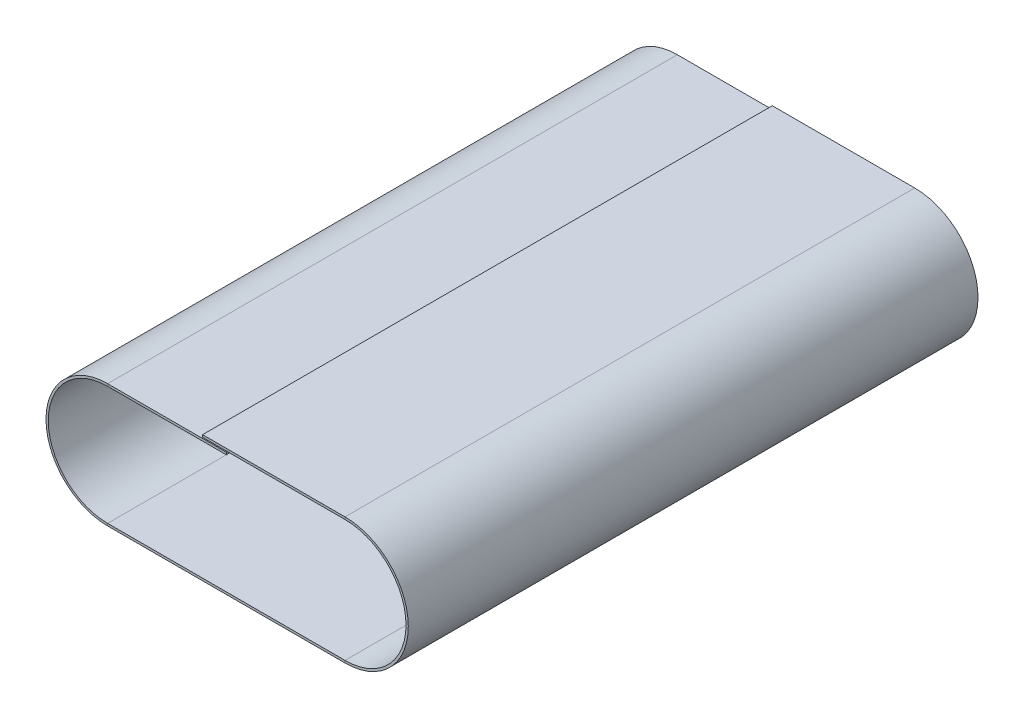
ISO-10303-21;
HEADER;
FILE_DESCRIPTION(('STEP AP214'),'2;1');
FILE_NAME('part.step','',(''),(''),'','','');
FILE_SCHEMA(('AUTOMOTIVE_DESIGN { 1 0 10303 214 1 1 1 1 }'));
ENDSEC;
DATA;
#1=APPLICATION_CONTEXT('core data for automotive mechanical design processes');
#2=APPLICATION_PROTOCOL_DEFINITION('international standard','automotive_design',2000,#1);
#3=PRODUCT_CONTEXT('',#1,'mechanical');
#4=PRODUCT('Part','Part','',(#3));
#5=PRODUCT_RELATED_PRODUCT_CATEGORY('part','',(#4));
#6=PRODUCT_DEFINITION_FORMATION('','',#4);
#7=PRODUCT_DEFINITION_CONTEXT('part definition',#1,'design');
#8=PRODUCT_DEFINITION('design','',#6,#7);
#9=PRODUCT_DEFINITION_SHAPE('','',#8);
#10=(LENGTH_UNIT() NAMED_UNIT(*) SI_UNIT(.MILLI.,.METRE.));
#11=(NAMED_UNIT(*) PLANE_ANGLE_UNIT() SI_UNIT($,.RADIAN.));
#12=(NAMED_UNIT(*) SI_UNIT($,.STERADIAN.) SOLID_ANGLE_UNIT());
#13=UNCERTAINTY_MEASURE_WITH_UNIT(LENGTH_MEASURE(1.E-05),#10,'distance_accuracy_value','');
#14=(GEOMETRIC_REPRESENTATION_CONTEXT(3) GLOBAL_UNCERTAINTY_ASSIGNED_CONTEXT((#13)) GLOBAL_UNIT_ASSIGNED_CONTEXT((#10,
#11,#12)) REPRESENTATION_CONTEXT('',''));
#15=CARTESIAN_POINT('',(0.,0.,0.));
#16=DIRECTION('',(0.,0.,1.));
#17=DIRECTION('',(1.,0.,0.));
#18=AXIS2_PLACEMENT_3D('',#15,#16,#17);
#19=CARTESIAN_POINT('',(0.,0.,304.8));
#20=DIRECTION('',(0.,0.,1.));
#21=DIRECTION('',(1.,0.,0.));
#22=AXIS2_PLACEMENT_3D('',#19,#20,#21);
#23=PLANE('',#22);
#24=DIRECTION('',(0.,-1.,0.));
#25=VECTOR('',#24,1.);
#26=CARTESIAN_POINT('',(0.,0.,304.8));
#27=LINE('',#26,#25);
#28=CARTESIAN_POINT('',(0.,0.,304.8));
#29=VERTEX_POINT('',#28);
#30=CARTESIAN_POINT('',(0.,-1.2192,304.8));
#31=VERTEX_POINT('',#30);
#32=EDGE_CURVE('E11',#29,#31,#27,.T.);
#33=ORIENTED_EDGE('',*,*,#32,.F.);
#34=CARTESIAN_POINT('',(0.,31.75,304.8));
#35=DIRECTION('',(0.,0.,1.));
#36=DIRECTION('',(-1.,0.,0.));
#37=AXIS2_PLACEMENT_3D('',#34,#35,#36);
#38=CIRCLE('',#37,31.75);
#39=CARTESIAN_POINT('',(0.,63.5,304.8));
#40=VERTEX_POINT('',#39);
#41=EDGE_CURVE('E247',#40,#29,#38,.T.);
#42=ORIENTED_EDGE('',*,*,#41,.F.);
#43=DIRECTION('',(0.,-1.,0.));
#44=VECTOR('',#43,1.);
#45=CARTESIAN_POINT('',(0.,64.7192,304.8));
#46=LINE('',#45,#44);
#47=CARTESIAN_POINT('',(0.,64.7192,304.8));
#48=VERTEX_POINT('',#47);
#49=EDGE_CURVE('E45',#48,#40,#46,.T.);
#50=ORIENTED_EDGE('',*,*,#49,.F.);
#51=CARTESIAN_POINT('',(0.,31.75,304.8));
#52=DIRECTION('',(0.,0.,1.));
#53=DIRECTION('',(1.,0.,0.));
#54=AXIS2_PLACEMENT_3D('',#51,#52,#53);
#55=CIRCLE('',#54,32.9692);
#56=EDGE_CURVE('E146',#48,#31,#55,.T.);
#57=ORIENTED_EDGE('',*,*,#56,.T.);
#58=EDGE_LOOP('',(#33,#42,#50,#57));
#59=FACE_BOUND('',#58,.T.);
#60=ADVANCED_FACE('F37',(#59),#23,.T.);
#61=CARTESIAN_POINT('',(0.,64.7192,304.8));
#62=DIRECTION('',(0.,0.,1.));
#63=DIRECTION('',(1.,0.,0.));
#64=AXIS2_PLACEMENT_3D('',#61,#62,#63);
#65=PLANE('',#64);
#66=DIRECTION('',(1.,0.,0.));
#67=VECTOR('',#66,1.);
#68=CARTESIAN_POINT('',(0.,0.,304.8));
#69=LINE('',#68,#67);
#70=CARTESIAN_POINT('',(127.,0.,304.8));
#71=VERTEX_POINT('',#70);
#72=EDGE_CURVE('E140',#29,#71,#69,.T.);
#73=ORIENTED_EDGE('',*,*,#72,.F.);
#74=ORIENTED_EDGE('',*,*,#32,.T.);
#75=DIRECTION('',(1.,0.,0.));
#76=VECTOR('',#75,1.);
#77=CARTESIAN_POINT('',(0.,-1.2192,304.8));
#78=LINE('',#77,#76);
#79=CARTESIAN_POINT('',(127.,-1.21919999999999,304.8));
#80=VERTEX_POINT('',#79);
#81=EDGE_CURVE('E137',#31,#80,#78,.T.);
#82=ORIENTED_EDGE('',*,*,#81,.T.);
#83=DIRECTION('',(0.,1.,0.));
#84=VECTOR('',#83,1.);
#85=CARTESIAN_POINT('',(127.,-1.21919999999999,304.8));
#86=LINE('',#85,#84);
#87=EDGE_CURVE('E228',#80,#71,#86,.T.);
#88=ORIENTED_EDGE('',*,*,#87,.T.);
#89=EDGE_LOOP('',(#73,#74,#82,#88));
#90=FACE_BOUND('',#89,.T.);
#91=ADVANCED_FACE('F135',(#90),#65,.T.);
#92=CARTESIAN_POINT('',(0.,63.5,0.));
#93=DIRECTION('',(0.,0.,-1.));
#94=DIRECTION('',(-1.,0.,0.));
#95=AXIS2_PLACEMENT_3D('',#92,#93,#94);
#96=PLANE('',#95);
#97=DIRECTION('',(0.,1.,0.));
#98=VECTOR('',#97,1.);
#99=CARTESIAN_POINT('',(0.,63.5,0.));
#100=LINE('',#99,#98);
#101=CARTESIAN_POINT('',(0.,63.5,0.));
#102=VERTEX_POINT('',#101);
#103=CARTESIAN_POINT('',(0.,64.7192,0.));
#104=VERTEX_POINT('',#103);
#105=EDGE_CURVE('E233',#102,#104,#100,.T.);
#106=ORIENTED_EDGE('',*,*,#105,.F.);
#107=CARTESIAN_POINT('',(0.,31.75,0.));
#108=DIRECTION('',(0.,0.,1.));
#109=DIRECTION('',(-1.,0.,0.));
#110=AXIS2_PLACEMENT_3D('',#107,#108,#109);
#111=CIRCLE('',#110,31.75);
#112=CARTESIAN_POINT('',(0.,0.,0.));
#113=VERTEX_POINT('',#112);
#114=EDGE_CURVE('E185',#102,#113,#111,.T.);
#115=ORIENTED_EDGE('',*,*,#114,.T.);
#116=DIRECTION('',(0.,1.,0.));
#117=VECTOR('',#116,1.);
#118=CARTESIAN_POINT('',(0.,-1.2192,0.));
#119=LINE('',#118,#117);
#120=CARTESIAN_POINT('',(0.,-1.2192,0.));
#121=VERTEX_POINT('',#120);
#122=EDGE_CURVE('E231',#121,#113,#119,.T.);
#123=ORIENTED_EDGE('',*,*,#122,.F.);
#124=CARTESIAN_POINT('',(0.,31.75,0.));
#125=DIRECTION('',(0.,0.,1.));
#126=DIRECTION('',(1.,0.,0.));
#127=AXIS2_PLACEMENT_3D('',#124,#125,#126);
#128=CIRCLE('',#127,32.9692);
#129=EDGE_CURVE('E158',#104,#121,#128,.T.);
#130=ORIENTED_EDGE('',*,*,#129,.F.);
#131=EDGE_LOOP('',(#106,#115,#123,#130));
#132=FACE_BOUND('',#131,.T.);
#133=ADVANCED_FACE('F285',(#132),#96,.T.);
#134=CARTESIAN_POINT('',(0.,-1.2192,0.));
#135=DIRECTION('',(0.,0.,-1.));
#136=DIRECTION('',(-1.,0.,0.));
#137=AXIS2_PLACEMENT_3D('',#134,#135,#136);
#138=PLANE('',#137);
#139=DIRECTION('',(-1.,0.,0.));
#140=VECTOR('',#139,1.);
#141=CARTESIAN_POINT('',(0.,63.5,0.));
#142=LINE('',#141,#140);
#143=CARTESIAN_POINT('',(63.5,63.5,0.));
#144=VERTEX_POINT('',#143);
#145=EDGE_CURVE('E188',#144,#102,#142,.T.);
#146=ORIENTED_EDGE('',*,*,#145,.T.);
#147=ORIENTED_EDGE('',*,*,#105,.T.);
#148=DIRECTION('',(1.,0.,0.));
#149=VECTOR('',#148,1.);
#150=CARTESIAN_POINT('',(0.,64.7192,0.));
#151=LINE('',#150,#149);
#152=CARTESIAN_POINT('',(63.5,64.7192,0.));
#153=VERTEX_POINT('',#152);
#154=EDGE_CURVE('E194',#153,#104,#151,.F.);
#155=ORIENTED_EDGE('',*,*,#154,.F.);
#156=DIRECTION('',(0.,-1.,0.));
#157=VECTOR('',#156,1.);
#158=CARTESIAN_POINT('',(63.5,64.7192,0.));
#159=LINE('',#158,#157);
#160=EDGE_CURVE('E191',#153,#144,#159,.T.);
#161=ORIENTED_EDGE('',*,*,#160,.T.);
#162=EDGE_LOOP('',(#146,#147,#155,#161));
#163=FACE_BOUND('',#162,.T.);
#164=ADVANCED_FACE('F288',(#163),#138,.T.);
#165=CARTESIAN_POINT('',(127.,65.278,304.8));
#166=DIRECTION('',(0.,0.,1.));
#167=DIRECTION('',(1.,0.,0.));
#168=AXIS2_PLACEMENT_3D('',#165,#166,#167);
#169=PLANE('',#168);
#170=DIRECTION('',(0.,1.,0.));
#171=VECTOR('',#170,1.);
#172=CARTESIAN_POINT('',(127.,65.278,304.8));
#173=LINE('',#172,#171);
#174=CARTESIAN_POINT('',(127.,65.278,304.8));
#175=VERTEX_POINT('',#174);
#176=CARTESIAN_POINT('',(127.,66.4972,304.8));
#177=VERTEX_POINT('',#176);
#178=EDGE_CURVE('E53',#175,#177,#173,.T.);
#179=ORIENTED_EDGE('',*,*,#178,.F.);
#180=CARTESIAN_POINT('',(127.,32.639,304.8));
#181=DIRECTION('',(0.,0.,1.));
#182=DIRECTION('',(1.,0.,0.));
#183=AXIS2_PLACEMENT_3D('',#180,#181,#182);
#184=CIRCLE('',#183,32.639);
#185=EDGE_CURVE('E257',#71,#175,#184,.T.);
#186=ORIENTED_EDGE('',*,*,#185,.F.);
#187=ORIENTED_EDGE('',*,*,#87,.F.);
#188=CARTESIAN_POINT('',(127.,32.639,304.8));
#189=DIRECTION('',(0.,0.,1.));
#190=DIRECTION('',(1.,0.,0.));
#191=AXIS2_PLACEMENT_3D('',#188,#189,#190);
#192=CIRCLE('',#191,33.8582);
#193=EDGE_CURVE('E166',#80,#177,#192,.T.);
#194=ORIENTED_EDGE('',*,*,#193,.T.);
#195=EDGE_LOOP('',(#179,#186,#187,#194));
#196=FACE_BOUND('',#195,.T.);
#197=ADVANCED_FACE('F280',(#196),#169,.T.);
#198=CARTESIAN_POINT('',(127.,-1.21919999999999,304.8));
#199=DIRECTION('',(0.,0.,1.));
#200=DIRECTION('',(1.,0.,0.));
#201=AXIS2_PLACEMENT_3D('',#198,#199,#200);
#202=PLANE('',#201);
#203=DIRECTION('',(-1.,0.,0.));
#204=VECTOR('',#203,1.);
#205=CARTESIAN_POINT('',(127.,65.278,304.8));
#206=LINE('',#205,#204);
#207=CARTESIAN_POINT('',(50.8,65.278,304.8));
#208=VERTEX_POINT('',#207);
#209=EDGE_CURVE('E260',#175,#208,#206,.T.);
#210=ORIENTED_EDGE('',*,*,#209,.F.);
#211=ORIENTED_EDGE('',*,*,#178,.T.);
#212=DIRECTION('',(-1.,0.,0.));
#213=VECTOR('',#212,1.);
#214=CARTESIAN_POINT('',(127.,66.4972,304.8));
#215=LINE('',#214,#213);
#216=CARTESIAN_POINT('',(50.8,66.4972,304.8));
#217=VERTEX_POINT('',#216);
#218=EDGE_CURVE('E107',#177,#217,#215,.T.);
#219=ORIENTED_EDGE('',*,*,#218,.T.);
#220=DIRECTION('',(0.,1.,0.));
#221=VECTOR('',#220,1.);
#222=CARTESIAN_POINT('',(50.8,65.278,304.8));
#223=LINE('',#222,#221);
#224=EDGE_CURVE('E263',#208,#217,#223,.T.);
#225=ORIENTED_EDGE('',*,*,#224,.F.);
#226=EDGE_LOOP('',(#210,#211,#219,#225));
#227=FACE_BOUND('',#226,.T.);
#228=ADVANCED_FACE('F269',(#227),#202,.T.);
#229=CARTESIAN_POINT('',(127.,0.,0.));
#230=DIRECTION('',(0.,0.,-1.));
#231=DIRECTION('',(-1.,0.,0.));
#232=AXIS2_PLACEMENT_3D('',#229,#230,#231);
#233=PLANE('',#232);
#234=DIRECTION('',(0.,-1.,0.));
#235=VECTOR('',#234,1.);
#236=CARTESIAN_POINT('',(127.,0.,0.));
#237=LINE('',#236,#235);
#238=CARTESIAN_POINT('',(127.,0.,0.));
#239=VERTEX_POINT('',#238);
#240=CARTESIAN_POINT('',(127.,-1.21919999999999,0.));
#241=VERTEX_POINT('',#240);
#242=EDGE_CURVE('E94',#239,#241,#237,.T.);
#243=ORIENTED_EDGE('',*,*,#242,.F.);
#244=CARTESIAN_POINT('',(127.,32.639,0.));
#245=DIRECTION('',(0.,0.,1.));
#246=DIRECTION('',(1.,0.,0.));
#247=AXIS2_PLACEMENT_3D('',#244,#245,#246);
#248=CIRCLE('',#247,32.639);
#249=CARTESIAN_POINT('',(127.,65.278,0.));
#250=VERTEX_POINT('',#249);
#251=EDGE_CURVE('E181',#239,#250,#248,.T.);
#252=ORIENTED_EDGE('',*,*,#251,.T.);
#253=DIRECTION('',(0.,-1.,0.));
#254=VECTOR('',#253,1.);
#255=CARTESIAN_POINT('',(127.,66.4972,0.));
#256=LINE('',#255,#254);
#257=CARTESIAN_POINT('',(127.,66.4972,0.));
#258=VERTEX_POINT('',#257);
#259=EDGE_CURVE('E101',#258,#250,#256,.T.);
#260=ORIENTED_EDGE('',*,*,#259,.F.);
#261=CARTESIAN_POINT('',(127.,32.639,0.));
#262=DIRECTION('',(0.,0.,1.));
#263=DIRECTION('',(1.,0.,0.));
#264=AXIS2_PLACEMENT_3D('',#261,#262,#263);
#265=CIRCLE('',#264,33.8582);
#266=EDGE_CURVE('E200',#241,#258,#265,.T.);
#267=ORIENTED_EDGE('',*,*,#266,.F.);
#268=EDGE_LOOP('',(#243,#252,#260,#267));
#269=FACE_BOUND('',#268,.T.);
#270=ADVANCED_FACE('F317',(#269),#233,.T.);
#271=CARTESIAN_POINT('',(127.,66.4972,0.));
#272=DIRECTION('',(0.,0.,-1.));
#273=DIRECTION('',(-1.,0.,0.));
#274=AXIS2_PLACEMENT_3D('',#271,#272,#273);
#275=PLANE('',#274);
#276=DIRECTION('',(1.,0.,0.));
#277=VECTOR('',#276,1.);
#278=CARTESIAN_POINT('',(0.,0.,0.));
#279=LINE('',#278,#277);
#280=EDGE_CURVE('E183',#113,#239,#279,.T.);
#281=ORIENTED_EDGE('',*,*,#280,.T.);
#282=ORIENTED_EDGE('',*,*,#242,.T.);
#283=DIRECTION('',(1.,0.,0.));
#284=VECTOR('',#283,1.);
#285=CARTESIAN_POINT('',(0.,-1.2192,0.));
#286=LINE('',#285,#284);
#287=EDGE_CURVE('E198',#121,#241,#286,.T.);
#288=ORIENTED_EDGE('',*,*,#287,.F.);
#289=ORIENTED_EDGE('',*,*,#122,.T.);
#290=EDGE_LOOP('',(#281,#282,#288,#289));
#291=FACE_BOUND('',#290,.T.);
#292=ADVANCED_FACE('F320',(#291),#275,.T.);
#293=CARTESIAN_POINT('',(127.,66.4972,304.8));
#294=DIRECTION('',(0.,-1.,0.));
#295=DIRECTION('',(1.,0.,0.));
#296=AXIS2_PLACEMENT_3D('',#293,#294,#295);
#297=PLANE('',#296);
#298=DIRECTION('',(-1.,0.,0.));
#299=VECTOR('',#298,1.);
#300=CARTESIAN_POINT('',(127.,66.4972,0.));
#301=LINE('',#300,#299);
#302=CARTESIAN_POINT('',(50.8,66.4972,0.));
#303=VERTEX_POINT('',#302);
#304=EDGE_CURVE('E172',#258,#303,#301,.T.);
#305=ORIENTED_EDGE('',*,*,#304,.T.);
#306=DIRECTION('',(0.,0.,-1.));
#307=VECTOR('',#306,1.);
#308=CARTESIAN_POINT('',(50.8,66.4972,304.8));
#309=LINE('',#308,#307);
#310=EDGE_CURVE('E224',#217,#303,#309,.T.);
#311=ORIENTED_EDGE('',*,*,#310,.F.);
#312=ORIENTED_EDGE('',*,*,#218,.F.);
#313=DIRECTION('',(0.,0.,-1.));
#314=VECTOR('',#313,1.);
#315=CARTESIAN_POINT('',(127.,66.4972,304.8));
#316=LINE('',#315,#314);
#317=EDGE_CURVE('E168',#177,#258,#316,.T.);
#318=ORIENTED_EDGE('',*,*,#317,.T.);
#319=EDGE_LOOP('',(#305,#311,#312,#318));
#320=FACE_BOUND('',#319,.T.);
#321=ADVANCED_FACE('F323',(#320),#297,.F.);
#322=CARTESIAN_POINT('',(50.8,65.278,304.8));
#323=DIRECTION('',(-1.,0.,0.));
#324=DIRECTION('',(0.,0.,1.));
#325=AXIS2_PLACEMENT_3D('',#322,#323,#324);
#326=PLANE('',#325);
#327=DIRECTION('',(0.,1.,0.));
#328=VECTOR('',#327,1.);
#329=CARTESIAN_POINT('',(50.8,65.278,0.));
#330=LINE('',#329,#328);
#331=CARTESIAN_POINT('',(50.8,65.278,0.));
#332=VERTEX_POINT('',#331);
#333=EDGE_CURVE('E175',#332,#303,#330,.T.);
#334=ORIENTED_EDGE('',*,*,#333,.F.);
#335=DIRECTION('',(0.,0.,-1.));
#336=VECTOR('',#335,1.);
#337=CARTESIAN_POINT('',(50.8,65.278,304.8));
#338=LINE('',#337,#336);
#339=EDGE_CURVE('E222',#208,#332,#338,.T.);
#340=ORIENTED_EDGE('',*,*,#339,.F.);
#341=ORIENTED_EDGE('',*,*,#224,.T.);
#342=ORIENTED_EDGE('',*,*,#310,.T.);
#343=EDGE_LOOP('',(#334,#340,#341,#342));
#344=FACE_BOUND('',#343,.T.);
#345=ADVANCED_FACE('F268',(#344),#326,.T.);
#346=CARTESIAN_POINT('',(127.,65.278,304.8));
#347=DIRECTION('',(0.,-1.,0.));
#348=DIRECTION('',(1.,0.,0.));
#349=AXIS2_PLACEMENT_3D('',#346,#347,#348);
#350=PLANE('',#349);
#351=DIRECTION('',(-1.,0.,0.));
#352=VECTOR('',#351,1.);
#353=CARTESIAN_POINT('',(127.,65.278,0.));
#354=LINE('',#353,#352);
#355=EDGE_CURVE('E178',#250,#332,#354,.T.);
#356=ORIENTED_EDGE('',*,*,#355,.F.);
#357=DIRECTION('',(0.,0.,-1.));
#358=VECTOR('',#357,1.);
#359=CARTESIAN_POINT('',(127.,65.278,304.8));
#360=LINE('',#359,#358);
#361=EDGE_CURVE('E219',#175,#250,#360,.T.);
#362=ORIENTED_EDGE('',*,*,#361,.F.);
#363=ORIENTED_EDGE('',*,*,#209,.T.);
#364=ORIENTED_EDGE('',*,*,#339,.T.);
#365=EDGE_LOOP('',(#356,#362,#363,#364));
#366=FACE_BOUND('',#365,.T.);
#367=ADVANCED_FACE('F273',(#366),#350,.T.);
#368=CARTESIAN_POINT('',(127.,32.639,304.8));
#369=DIRECTION('',(0.,0.,-1.));
#370=DIRECTION('',(-1.,0.,0.));
#371=AXIS2_PLACEMENT_3D('',#368,#369,#370);
#372=CYLINDRICAL_SURFACE('',#371,32.639);
#373=ORIENTED_EDGE('',*,*,#251,.F.);
#374=DIRECTION('',(0.,0.,-1.));
#375=VECTOR('',#374,1.);
#376=CARTESIAN_POINT('',(127.,0.,304.8));
#377=LINE('',#376,#375);
#378=EDGE_CURVE('E216',#71,#239,#377,.T.);
#379=ORIENTED_EDGE('',*,*,#378,.F.);
#380=ORIENTED_EDGE('',*,*,#185,.T.);
#381=ORIENTED_EDGE('',*,*,#361,.T.);
#382=EDGE_LOOP('',(#373,#379,#380,#381));
#383=FACE_BOUND('',#382,.T.);
#384=ADVANCED_FACE('F276',(#383),#372,.F.);
#385=CARTESIAN_POINT('',(0.,0.,304.8));
#386=DIRECTION('',(0.,1.,0.));
#387=DIRECTION('',(0.,0.,1.));
#388=AXIS2_PLACEMENT_3D('',#385,#386,#387);
#389=PLANE('',#388);
#390=ORIENTED_EDGE('',*,*,#280,.F.);
#391=DIRECTION('',(0.,0.,-1.));
#392=VECTOR('',#391,1.);
#393=CARTESIAN_POINT('',(0.,0.,304.8));
#394=LINE('',#393,#392);
#395=EDGE_CURVE('E213',#29,#113,#394,.T.);
#396=ORIENTED_EDGE('',*,*,#395,.F.);
#397=ORIENTED_EDGE('',*,*,#72,.T.);
#398=ORIENTED_EDGE('',*,*,#378,.T.);
#399=EDGE_LOOP('',(#390,#396,#397,#398));
#400=FACE_BOUND('',#399,.T.);
#401=ADVANCED_FACE('F283',(#400),#389,.T.);
#402=CARTESIAN_POINT('',(0.,31.75,304.8));
#403=DIRECTION('',(0.,0.,-1.));
#404=DIRECTION('',(-1.,0.,0.));
#405=AXIS2_PLACEMENT_3D('',#402,#403,#404);
#406=CYLINDRICAL_SURFACE('',#405,31.75);
#407=ORIENTED_EDGE('',*,*,#114,.F.);
#408=DIRECTION('',(0.,0.,-1.));
#409=VECTOR('',#408,1.);
#410=CARTESIAN_POINT('',(0.,63.5,304.8));
#411=LINE('',#410,#409);
#412=EDGE_CURVE('E210',#40,#102,#411,.T.);
#413=ORIENTED_EDGE('',*,*,#412,.F.);
#414=ORIENTED_EDGE('',*,*,#41,.T.);
#415=ORIENTED_EDGE('',*,*,#395,.T.);
#416=EDGE_LOOP('',(#407,#413,#414,#415));
#417=FACE_BOUND('',#416,.T.);
#418=ADVANCED_FACE('F246',(#417),#406,.F.);
#419=CARTESIAN_POINT('',(0.,63.5,304.8));
#420=DIRECTION('',(0.,-1.,0.));
#421=DIRECTION('',(0.,0.,-1.));
#422=AXIS2_PLACEMENT_3D('',#419,#420,#421);
#423=PLANE('',#422);
#424=ORIENTED_EDGE('',*,*,#145,.F.);
#425=DIRECTION('',(0.,0.,-1.));
#426=VECTOR('',#425,1.);
#427=CARTESIAN_POINT('',(63.5,63.5,304.8));
#428=LINE('',#427,#426);
#429=CARTESIAN_POINT('',(63.5,63.5,304.8));
#430=VERTEX_POINT('',#429);
#431=EDGE_CURVE('E208',#430,#144,#428,.T.);
#432=ORIENTED_EDGE('',*,*,#431,.F.);
#433=DIRECTION('',(-1.,0.,0.));
#434=VECTOR('',#433,1.);
#435=CARTESIAN_POINT('',(0.,63.5,304.8));
#436=LINE('',#435,#434);
#437=EDGE_CURVE('E240',#430,#40,#436,.T.);
#438=ORIENTED_EDGE('',*,*,#437,.T.);
#439=ORIENTED_EDGE('',*,*,#412,.T.);
#440=EDGE_LOOP('',(#424,#432,#438,#439));
#441=FACE_BOUND('',#440,.T.);
#442=ADVANCED_FACE('F251',(#441),#423,.T.);
#443=CARTESIAN_POINT('',(63.5,64.7192,304.8));
#444=DIRECTION('',(1.,0.,0.));
#445=DIRECTION('',(0.,0.,-1.));
#446=AXIS2_PLACEMENT_3D('',#443,#444,#445);
#447=PLANE('',#446);
#448=ORIENTED_EDGE('',*,*,#160,.F.);
#449=DIRECTION('',(0.,0.,-1.));
#450=VECTOR('',#449,1.);
#451=CARTESIAN_POINT('',(63.5,64.7192,304.8));
#452=LINE('',#451,#450);
#453=CARTESIAN_POINT('',(63.5,64.7192,304.8));
#454=VERTEX_POINT('',#453);
#455=EDGE_CURVE('E206',#454,#153,#452,.T.);
#456=ORIENTED_EDGE('',*,*,#455,.F.);
#457=DIRECTION('',(0.,-1.,0.));
#458=VECTOR('',#457,1.);
#459=CARTESIAN_POINT('',(63.5,64.7192,304.8));
#460=LINE('',#459,#458);
#461=EDGE_CURVE('E252',#454,#430,#460,.T.);
#462=ORIENTED_EDGE('',*,*,#461,.T.);
#463=ORIENTED_EDGE('',*,*,#431,.T.);
#464=EDGE_LOOP('',(#448,#456,#462,#463));
#465=FACE_BOUND('',#464,.T.);
#466=ADVANCED_FACE('F293',(#465),#447,.T.);
#467=CARTESIAN_POINT('',(0.,64.7192,304.8));
#468=DIRECTION('',(0.,-1.,0.));
#469=DIRECTION('',(0.,0.,-1.));
#470=AXIS2_PLACEMENT_3D('',#467,#468,#469);
#471=PLANE('',#470);
#472=ORIENTED_EDGE('',*,*,#154,.T.);
#473=DIRECTION('',(0.,0.,-1.));
#474=VECTOR('',#473,1.);
#475=CARTESIAN_POINT('',(0.,64.7192,304.8));
#476=LINE('',#475,#474);
#477=EDGE_CURVE('E160',#48,#104,#476,.T.);
#478=ORIENTED_EDGE('',*,*,#477,.F.);
#479=DIRECTION('',(1.,0.,0.));
#480=VECTOR('',#479,1.);
#481=CARTESIAN_POINT('',(0.,64.7192,304.8));
#482=LINE('',#481,#480);
#483=EDGE_CURVE('E151',#454,#48,#482,.F.);
#484=ORIENTED_EDGE('',*,*,#483,.F.);
#485=ORIENTED_EDGE('',*,*,#455,.T.);
#486=EDGE_LOOP('',(#472,#478,#484,#485));
#487=FACE_BOUND('',#486,.T.);
#488=ADVANCED_FACE('F291',(#487),#471,.F.);
#489=CARTESIAN_POINT('',(0.,31.75,304.8));
#490=DIRECTION('',(0.,0.,-1.));
#491=DIRECTION('',(-1.,0.,0.));
#492=AXIS2_PLACEMENT_3D('',#489,#490,#491);
#493=CYLINDRICAL_SURFACE('',#492,32.9692);
#494=ORIENTED_EDGE('',*,*,#129,.T.);
#495=DIRECTION('',(0.,0.,-1.));
#496=VECTOR('',#495,1.);
#497=CARTESIAN_POINT('',(0.,-1.2192,304.8));
#498=LINE('',#497,#496);
#499=EDGE_CURVE('E155',#31,#121,#498,.T.);
#500=ORIENTED_EDGE('',*,*,#499,.F.);
#501=ORIENTED_EDGE('',*,*,#56,.F.);
#502=ORIENTED_EDGE('',*,*,#477,.T.);
#503=EDGE_LOOP('',(#494,#500,#501,#502));
#504=FACE_BOUND('',#503,.T.);
#505=ADVANCED_FACE('F156',(#504),#493,.T.);
#506=CARTESIAN_POINT('',(0.,-1.2192,304.8));
#507=DIRECTION('',(0.,1.,0.));
#508=DIRECTION('',(0.,0.,1.));
#509=AXIS2_PLACEMENT_3D('',#506,#507,#508);
#510=PLANE('',#509);
#511=ORIENTED_EDGE('',*,*,#287,.T.);
#512=DIRECTION('',(0.,0.,-1.));
#513=VECTOR('',#512,1.);
#514=CARTESIAN_POINT('',(127.,-1.21919999999999,304.8));
#515=LINE('',#514,#513);
#516=EDGE_CURVE('E161',#80,#241,#515,.T.);
#517=ORIENTED_EDGE('',*,*,#516,.F.);
#518=ORIENTED_EDGE('',*,*,#81,.F.);
#519=ORIENTED_EDGE('',*,*,#499,.T.);
#520=EDGE_LOOP('',(#511,#517,#518,#519));
#521=FACE_BOUND('',#520,.T.);
#522=ADVANCED_FACE('F163',(#521),#510,.F.);
#523=CARTESIAN_POINT('',(127.,32.639,304.8));
#524=DIRECTION('',(0.,0.,-1.));
#525=DIRECTION('',(-1.,0.,0.));
#526=AXIS2_PLACEMENT_3D('',#523,#524,#525);
#527=CYLINDRICAL_SURFACE('',#526,33.8582);
#528=ORIENTED_EDGE('',*,*,#266,.T.);
#529=ORIENTED_EDGE('',*,*,#317,.F.);
#530=ORIENTED_EDGE('',*,*,#193,.F.);
#531=ORIENTED_EDGE('',*,*,#516,.T.);
#532=EDGE_LOOP('',(#528,#529,#530,#531));
#533=FACE_BOUND('',#532,.T.);
#534=ADVANCED_FACE('F375',(#533),#527,.T.);
#535=CARTESIAN_POINT('',(127.,32.639,304.8));
#536=DIRECTION('',(0.,0.,1.));
#537=DIRECTION('',(1.,0.,0.));
#538=AXIS2_PLACEMENT_3D('',#535,#536,#537);
#539=PLANE('',#538);
#540=ORIENTED_EDGE('',*,*,#483,.T.);
#541=ORIENTED_EDGE('',*,*,#49,.T.);
#542=ORIENTED_EDGE('',*,*,#437,.F.);
#543=ORIENTED_EDGE('',*,*,#461,.F.);
#544=EDGE_LOOP('',(#540,#541,#542,#543));
#545=FACE_BOUND('',#544,.T.);
#546=ADVANCED_FACE('F237',(#545),#539,.T.);
#547=CARTESIAN_POINT('',(127.,32.639,0.));
#548=DIRECTION('',(0.,0.,1.));
#549=DIRECTION('',(1.,0.,0.));
#550=AXIS2_PLACEMENT_3D('',#547,#548,#549);
#551=PLANE('',#550);
#552=ORIENTED_EDGE('',*,*,#304,.F.);
#553=ORIENTED_EDGE('',*,*,#259,.T.);
#554=ORIENTED_EDGE('',*,*,#355,.T.);
#555=ORIENTED_EDGE('',*,*,#333,.T.);
#556=EDGE_LOOP('',(#552,#553,#554,#555));
#557=FACE_BOUND('',#556,.T.);
#558=ADVANCED_FACE('F395',(#557),#551,.F.);
#559=CLOSED_SHELL('',(#60,#91,#133,#164,#197,#228,#270,#292,#321,#345,#367,#384,#401,#418,#442,
#466,#488,#505,#522,#534,#546,#558));
#560=MANIFOLD_SOLID_BREP('B2',#559);
#561=ADVANCED_BREP_SHAPE_REPRESENTATION('',(#18,#560),#14);
#562=SHAPE_DEFINITION_REPRESENTATION(#9,#561);
ENDSEC;
END-ISO-10303-21;
